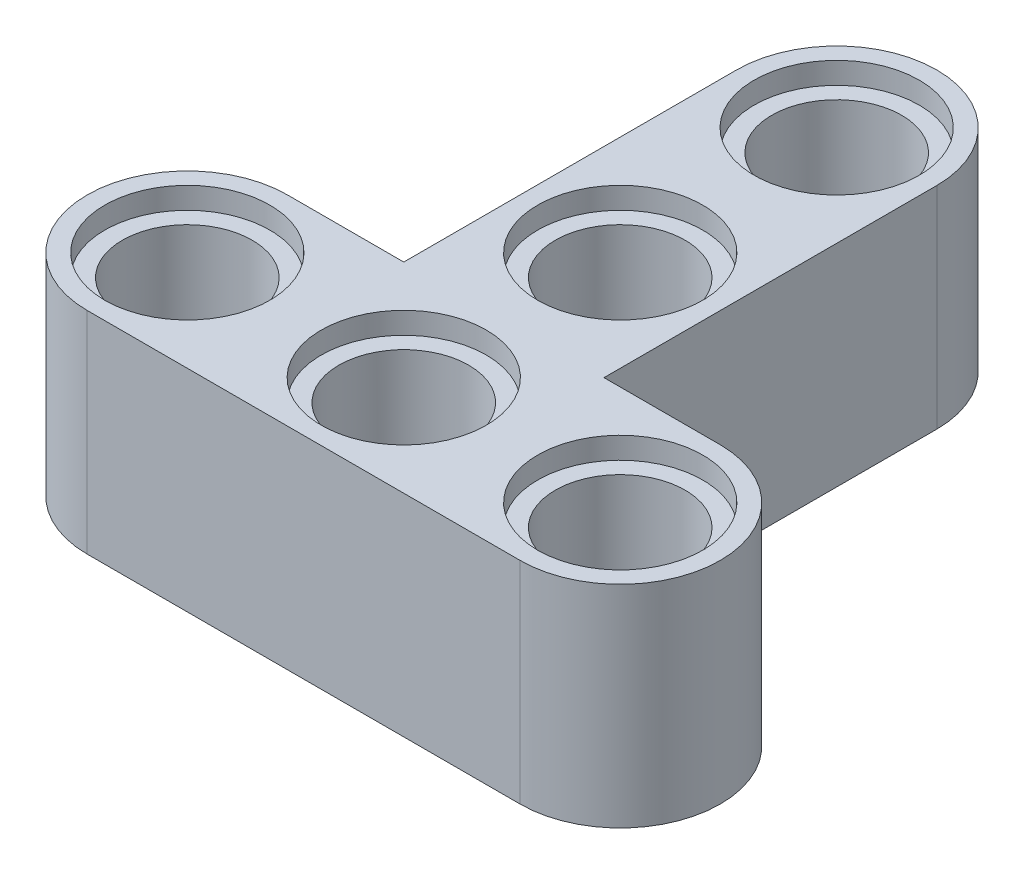
ISO-10303-21;
HEADER;
FILE_DESCRIPTION(('STEP AP214'),'2;1');
FILE_NAME('part.step','',(''),(''),'','','');
FILE_SCHEMA(('AUTOMOTIVE_DESIGN { 1 0 10303 214 1 1 1 1 }'));
ENDSEC;
DATA;
#1=APPLICATION_CONTEXT('core data for automotive mechanical design processes');
#2=APPLICATION_PROTOCOL_DEFINITION('international standard','automotive_design',2000,#1);
#3=PRODUCT_CONTEXT('',#1,'mechanical');
#4=PRODUCT('Part','Part','',(#3));
#5=PRODUCT_RELATED_PRODUCT_CATEGORY('part','',(#4));
#6=PRODUCT_DEFINITION_FORMATION('','',#4);
#7=PRODUCT_DEFINITION_CONTEXT('part definition',#1,'design');
#8=PRODUCT_DEFINITION('design','',#6,#7);
#9=PRODUCT_DEFINITION_SHAPE('','',#8);
#10=(LENGTH_UNIT() NAMED_UNIT(*) SI_UNIT(.MILLI.,.METRE.));
#11=(NAMED_UNIT(*) PLANE_ANGLE_UNIT() SI_UNIT($,.RADIAN.));
#12=(NAMED_UNIT(*) SI_UNIT($,.STERADIAN.) SOLID_ANGLE_UNIT());
#13=UNCERTAINTY_MEASURE_WITH_UNIT(LENGTH_MEASURE(1.E-05),#10,'distance_accuracy_value','');
#14=(GEOMETRIC_REPRESENTATION_CONTEXT(3) GLOBAL_UNCERTAINTY_ASSIGNED_CONTEXT((#13)) GLOBAL_UNIT_ASSIGNED_CONTEXT((#10,
#11,#12)) REPRESENTATION_CONTEXT('',''));
#15=CARTESIAN_POINT('',(0.,0.,0.));
#16=DIRECTION('',(0.,0.,1.));
#17=DIRECTION('',(1.,0.,0.));
#18=AXIS2_PLACEMENT_3D('',#15,#16,#17);
#19=CARTESIAN_POINT('',(-16.,0.,0.));
#20=DIRECTION('',(0.,1.,0.));
#21=DIRECTION('',(0.,0.,1.));
#22=AXIS2_PLACEMENT_3D('',#19,#20,#21);
#23=CYLINDRICAL_SURFACE('',#22,2.4);
#24=CARTESIAN_POINT('',(-16.,7.,0.));
#25=DIRECTION('',(0.,1.,0.));
#26=DIRECTION('',(0.,0.,1.));
#27=AXIS2_PLACEMENT_3D('',#24,#25,#26);
#28=CIRCLE('',#27,2.4);
#29=CARTESIAN_POINT('',(-16.,7.,2.4));
#30=VERTEX_POINT('',#29);
#31=EDGE_CURVE('E176',#30,#30,#28,.F.);
#32=ORIENTED_EDGE('',*,*,#31,.F.);
#33=EDGE_LOOP('',(#32));
#34=FACE_BOUND('',#33,.T.);
#35=CARTESIAN_POINT('',(-16.,0.8,0.));
#36=DIRECTION('',(0.,-1.,0.));
#37=DIRECTION('',(0.,0.,-1.));
#38=AXIS2_PLACEMENT_3D('',#35,#36,#37);
#39=CIRCLE('',#38,2.4);
#40=CARTESIAN_POINT('',(-16.,0.8,-2.4));
#41=VERTEX_POINT('',#40);
#42=EDGE_CURVE('E40',#41,#41,#39,.F.);
#43=ORIENTED_EDGE('',*,*,#42,.F.);
#44=EDGE_LOOP('',(#43));
#45=FACE_BOUND('',#44,.T.);
#46=ADVANCED_FACE('F36',(#34,#45),#23,.F.);
#47=CARTESIAN_POINT('',(-8.,0.,-8.));
#48=DIRECTION('',(0.,1.,0.));
#49=DIRECTION('',(0.,0.,1.));
#50=AXIS2_PLACEMENT_3D('',#47,#48,#49);
#51=CYLINDRICAL_SURFACE('',#50,2.4);
#52=CARTESIAN_POINT('',(-8.,7.,-8.));
#53=DIRECTION('',(0.,1.,0.));
#54=DIRECTION('',(0.,0.,1.));
#55=AXIS2_PLACEMENT_3D('',#52,#53,#54);
#56=CIRCLE('',#55,2.4);
#57=CARTESIAN_POINT('',(-8.,7.,-5.6));
#58=VERTEX_POINT('',#57);
#59=EDGE_CURVE('E169',#58,#58,#56,.F.);
#60=ORIENTED_EDGE('',*,*,#59,.F.);
#61=EDGE_LOOP('',(#60));
#62=FACE_BOUND('',#61,.T.);
#63=CARTESIAN_POINT('',(-8.,0.8,-8.));
#64=DIRECTION('',(0.,-1.,0.));
#65=DIRECTION('',(0.,0.,-1.));
#66=AXIS2_PLACEMENT_3D('',#63,#64,#65);
#67=CIRCLE('',#66,2.4);
#68=CARTESIAN_POINT('',(-8.,0.8,-10.4));
#69=VERTEX_POINT('',#68);
#70=EDGE_CURVE('E190',#69,#69,#67,.F.);
#71=ORIENTED_EDGE('',*,*,#70,.F.);
#72=EDGE_LOOP('',(#71));
#73=FACE_BOUND('',#72,.T.);
#74=ADVANCED_FACE('F255',(#62,#73),#51,.F.);
#75=CARTESIAN_POINT('',(0.,0.,0.));
#76=DIRECTION('',(0.,1.,0.));
#77=DIRECTION('',(0.,0.,1.));
#78=AXIS2_PLACEMENT_3D('',#75,#76,#77);
#79=CYLINDRICAL_SURFACE('',#78,2.4);
#80=CARTESIAN_POINT('',(0.,7.,0.));
#81=DIRECTION('',(0.,1.,0.));
#82=DIRECTION('',(0.,0.,1.));
#83=AXIS2_PLACEMENT_3D('',#80,#81,#82);
#84=CIRCLE('',#83,2.4);
#85=CARTESIAN_POINT('',(0.,7.,2.4));
#86=VERTEX_POINT('',#85);
#87=EDGE_CURVE('E166',#86,#86,#84,.F.);
#88=ORIENTED_EDGE('',*,*,#87,.F.);
#89=EDGE_LOOP('',(#88));
#90=FACE_BOUND('',#89,.T.);
#91=CARTESIAN_POINT('',(0.,0.8,0.));
#92=DIRECTION('',(0.,-1.,0.));
#93=DIRECTION('',(0.,0.,-1.));
#94=AXIS2_PLACEMENT_3D('',#91,#92,#93);
#95=CIRCLE('',#94,2.4);
#96=CARTESIAN_POINT('',(0.,0.8,-2.4));
#97=VERTEX_POINT('',#96);
#98=EDGE_CURVE('E188',#97,#97,#95,.F.);
#99=ORIENTED_EDGE('',*,*,#98,.F.);
#100=EDGE_LOOP('',(#99));
#101=FACE_BOUND('',#100,.T.);
#102=ADVANCED_FACE('F251',(#90,#101),#79,.F.);
#103=CARTESIAN_POINT('',(-8.,0.,-16.));
#104=DIRECTION('',(0.,1.,0.));
#105=DIRECTION('',(0.,0.,1.));
#106=AXIS2_PLACEMENT_3D('',#103,#104,#105);
#107=CYLINDRICAL_SURFACE('',#106,2.4);
#108=CARTESIAN_POINT('',(-8.,7.,-16.));
#109=DIRECTION('',(0.,-1.,0.));
#110=DIRECTION('',(0.,0.,-1.));
#111=AXIS2_PLACEMENT_3D('',#108,#109,#110);
#112=CIRCLE('',#111,2.4);
#113=CARTESIAN_POINT('',(-8.,7.,-18.4));
#114=VERTEX_POINT('',#113);
#115=EDGE_CURVE('E173',#114,#114,#112,.F.);
#116=ORIENTED_EDGE('',*,*,#115,.T.);
#117=EDGE_LOOP('',(#116));
#118=FACE_BOUND('',#117,.T.);
#119=CARTESIAN_POINT('',(-8.,0.8,-16.));
#120=DIRECTION('',(0.,-1.,0.));
#121=DIRECTION('',(0.,0.,-1.));
#122=AXIS2_PLACEMENT_3D('',#119,#120,#121);
#123=CIRCLE('',#122,2.4);
#124=CARTESIAN_POINT('',(-8.,0.8,-18.4));
#125=VERTEX_POINT('',#124);
#126=EDGE_CURVE('E181',#125,#125,#123,.F.);
#127=ORIENTED_EDGE('',*,*,#126,.F.);
#128=EDGE_LOOP('',(#127));
#129=FACE_BOUND('',#128,.T.);
#130=ADVANCED_FACE('F245',(#118,#129),#107,.F.);
#131=CARTESIAN_POINT('',(-16.,7.8,-3.7));
#132=DIRECTION('',(0.,0.,-1.));
#133=DIRECTION('',(-1.,0.,0.));
#134=AXIS2_PLACEMENT_3D('',#131,#132,#133);
#135=PLANE('',#134);
#136=DIRECTION('',(1.,0.,0.));
#137=VECTOR('',#136,1.);
#138=CARTESIAN_POINT('',(-16.,0.,-3.7));
#139=LINE('',#138,#137);
#140=CARTESIAN_POINT('',(-16.,0.,-3.7));
#141=VERTEX_POINT('',#140);
#142=CARTESIAN_POINT('',(-11.7,0.,-3.7));
#143=VERTEX_POINT('',#142);
#144=EDGE_CURVE('E136',#141,#143,#139,.T.);
#145=ORIENTED_EDGE('',*,*,#144,.F.);
#146=DIRECTION('',(0.,-1.,0.));
#147=VECTOR('',#146,1.);
#148=CARTESIAN_POINT('',(-16.,7.8,-3.7));
#149=LINE('',#148,#147);
#150=CARTESIAN_POINT('',(-16.,7.8,-3.7));
#151=VERTEX_POINT('',#150);
#152=EDGE_CURVE('E11',#151,#141,#149,.T.);
#153=ORIENTED_EDGE('',*,*,#152,.F.);
#154=DIRECTION('',(1.,0.,0.));
#155=VECTOR('',#154,1.);
#156=CARTESIAN_POINT('',(-16.,7.8,-3.7));
#157=LINE('',#156,#155);
#158=CARTESIAN_POINT('',(-11.7,7.8,-3.7));
#159=VERTEX_POINT('',#158);
#160=EDGE_CURVE('E154',#151,#159,#157,.T.);
#161=ORIENTED_EDGE('',*,*,#160,.T.);
#162=DIRECTION('',(0.,-1.,0.));
#163=VECTOR('',#162,1.);
#164=CARTESIAN_POINT('',(-11.7,7.8,-3.7));
#165=LINE('',#164,#163);
#166=EDGE_CURVE('E135',#159,#143,#165,.T.);
#167=ORIENTED_EDGE('',*,*,#166,.T.);
#168=EDGE_LOOP('',(#145,#153,#161,#167));
#169=FACE_BOUND('',#168,.T.);
#170=ADVANCED_FACE('F38',(#169),#135,.T.);
#171=CARTESIAN_POINT('',(-16.,7.8,0.));
#172=DIRECTION('',(0.,-1.,0.));
#173=DIRECTION('',(0.,0.,-1.));
#174=AXIS2_PLACEMENT_3D('',#171,#172,#173);
#175=CYLINDRICAL_SURFACE('',#174,3.7);
#176=CARTESIAN_POINT('',(-16.,0.,0.));
#177=DIRECTION('',(0.,1.,0.));
#178=DIRECTION('',(0.,0.,1.));
#179=AXIS2_PLACEMENT_3D('',#176,#177,#178);
#180=CIRCLE('',#179,3.7);
#181=CARTESIAN_POINT('',(-16.,0.,3.7));
#182=VERTEX_POINT('',#181);
#183=EDGE_CURVE('E82',#141,#182,#180,.T.);
#184=ORIENTED_EDGE('',*,*,#183,.T.);
#185=DIRECTION('',(0.,-1.,0.));
#186=VECTOR('',#185,1.);
#187=CARTESIAN_POINT('',(-16.,7.8,3.7));
#188=LINE('',#187,#186);
#189=CARTESIAN_POINT('',(-16.,7.8,3.7));
#190=VERTEX_POINT('',#189);
#191=EDGE_CURVE('E46',#190,#182,#188,.T.);
#192=ORIENTED_EDGE('',*,*,#191,.F.);
#193=CARTESIAN_POINT('',(-16.,7.8,0.));
#194=DIRECTION('',(0.,1.,0.));
#195=DIRECTION('',(0.,0.,1.));
#196=AXIS2_PLACEMENT_3D('',#193,#194,#195);
#197=CIRCLE('',#196,3.7);
#198=EDGE_CURVE('E114',#151,#190,#197,.T.);
#199=ORIENTED_EDGE('',*,*,#198,.F.);
#200=ORIENTED_EDGE('',*,*,#152,.T.);
#201=EDGE_LOOP('',(#184,#192,#199,#200));
#202=FACE_BOUND('',#201,.T.);
#203=ADVANCED_FACE('F244',(#202),#175,.T.);
#204=CARTESIAN_POINT('',(-16.,7.8,3.7));
#205=DIRECTION('',(0.,0.,-1.));
#206=DIRECTION('',(-1.,0.,0.));
#207=AXIS2_PLACEMENT_3D('',#204,#205,#206);
#208=PLANE('',#207);
#209=DIRECTION('',(1.,0.,0.));
#210=VECTOR('',#209,1.);
#211=CARTESIAN_POINT('',(-16.,0.,3.7));
#212=LINE('',#211,#210);
#213=CARTESIAN_POINT('',(0.,0.,3.7));
#214=VERTEX_POINT('',#213);
#215=EDGE_CURVE('E121',#182,#214,#212,.T.);
#216=ORIENTED_EDGE('',*,*,#215,.T.);
#217=DIRECTION('',(0.,-1.,0.));
#218=VECTOR('',#217,1.);
#219=CARTESIAN_POINT('',(0.,7.8,3.7));
#220=LINE('',#219,#218);
#221=CARTESIAN_POINT('',(0.,7.8,3.7));
#222=VERTEX_POINT('',#221);
#223=EDGE_CURVE('E118',#222,#214,#220,.T.);
#224=ORIENTED_EDGE('',*,*,#223,.F.);
#225=DIRECTION('',(1.,0.,0.));
#226=VECTOR('',#225,1.);
#227=CARTESIAN_POINT('',(-16.,7.8,3.7));
#228=LINE('',#227,#226);
#229=EDGE_CURVE('E107',#190,#222,#228,.T.);
#230=ORIENTED_EDGE('',*,*,#229,.F.);
#231=ORIENTED_EDGE('',*,*,#191,.T.);
#232=EDGE_LOOP('',(#216,#224,#230,#231));
#233=FACE_BOUND('',#232,.T.);
#234=ADVANCED_FACE('F119',(#233),#208,.F.);
#235=CARTESIAN_POINT('',(0.,7.8,0.));
#236=DIRECTION('',(0.,-1.,0.));
#237=DIRECTION('',(0.,0.,-1.));
#238=AXIS2_PLACEMENT_3D('',#235,#236,#237);
#239=CYLINDRICAL_SURFACE('',#238,3.7);
#240=CARTESIAN_POINT('',(0.,0.,0.));
#241=DIRECTION('',(0.,-1.,0.));
#242=DIRECTION('',(0.,0.,-1.));
#243=AXIS2_PLACEMENT_3D('',#240,#241,#242);
#244=CIRCLE('',#243,3.7);
#245=CARTESIAN_POINT('',(0.,0.,-3.7));
#246=VERTEX_POINT('',#245);
#247=EDGE_CURVE('E151',#246,#214,#244,.T.);
#248=ORIENTED_EDGE('',*,*,#247,.F.);
#249=DIRECTION('',(0.,-1.,0.));
#250=VECTOR('',#249,1.);
#251=CARTESIAN_POINT('',(0.,7.8,-3.7));
#252=LINE('',#251,#250);
#253=CARTESIAN_POINT('',(0.,7.8,-3.7));
#254=VERTEX_POINT('',#253);
#255=EDGE_CURVE('E125',#254,#246,#252,.T.);
#256=ORIENTED_EDGE('',*,*,#255,.F.);
#257=CARTESIAN_POINT('',(0.,7.8,0.));
#258=DIRECTION('',(0.,-1.,0.));
#259=DIRECTION('',(0.,0.,-1.));
#260=AXIS2_PLACEMENT_3D('',#257,#258,#259);
#261=CIRCLE('',#260,3.7);
#262=EDGE_CURVE('E112',#254,#222,#261,.T.);
#263=ORIENTED_EDGE('',*,*,#262,.T.);
#264=ORIENTED_EDGE('',*,*,#223,.T.);
#265=EDGE_LOOP('',(#248,#256,#263,#264));
#266=FACE_BOUND('',#265,.T.);
#267=ADVANCED_FACE('F127',(#266),#239,.T.);
#268=CARTESIAN_POINT('',(-4.3,7.8,-3.7));
#269=DIRECTION('',(0.,0.,-1.));
#270=DIRECTION('',(-1.,0.,0.));
#271=AXIS2_PLACEMENT_3D('',#268,#269,#270);
#272=PLANE('',#271);
#273=DIRECTION('',(1.,0.,0.));
#274=VECTOR('',#273,1.);
#275=CARTESIAN_POINT('',(-4.3,0.,-3.7));
#276=LINE('',#275,#274);
#277=CARTESIAN_POINT('',(-4.3,0.,-3.7));
#278=VERTEX_POINT('',#277);
#279=EDGE_CURVE('E148',#278,#246,#276,.T.);
#280=ORIENTED_EDGE('',*,*,#279,.F.);
#281=DIRECTION('',(0.,-1.,0.));
#282=VECTOR('',#281,1.);
#283=CARTESIAN_POINT('',(-4.3,7.8,-3.7));
#284=LINE('',#283,#282);
#285=CARTESIAN_POINT('',(-4.3,7.8,-3.7));
#286=VERTEX_POINT('',#285);
#287=EDGE_CURVE('E158',#286,#278,#284,.T.);
#288=ORIENTED_EDGE('',*,*,#287,.F.);
#289=DIRECTION('',(1.,0.,0.));
#290=VECTOR('',#289,1.);
#291=CARTESIAN_POINT('',(-4.3,7.8,-3.7));
#292=LINE('',#291,#290);
#293=EDGE_CURVE('E128',#286,#254,#292,.T.);
#294=ORIENTED_EDGE('',*,*,#293,.T.);
#295=ORIENTED_EDGE('',*,*,#255,.T.);
#296=EDGE_LOOP('',(#280,#288,#294,#295));
#297=FACE_BOUND('',#296,.T.);
#298=ADVANCED_FACE('F234',(#297),#272,.T.);
#299=CARTESIAN_POINT('',(-4.3,7.8,-16.));
#300=DIRECTION('',(1.,0.,0.));
#301=DIRECTION('',(0.,0.,-1.));
#302=AXIS2_PLACEMENT_3D('',#299,#300,#301);
#303=PLANE('',#302);
#304=DIRECTION('',(0.,0.,1.));
#305=VECTOR('',#304,1.);
#306=CARTESIAN_POINT('',(-4.3,0.,-16.));
#307=LINE('',#306,#305);
#308=CARTESIAN_POINT('',(-4.3,0.,-16.));
#309=VERTEX_POINT('',#308);
#310=EDGE_CURVE('E145',#309,#278,#307,.T.);
#311=ORIENTED_EDGE('',*,*,#310,.F.);
#312=DIRECTION('',(0.,-1.,0.));
#313=VECTOR('',#312,1.);
#314=CARTESIAN_POINT('',(-4.3,7.8,-16.));
#315=LINE('',#314,#313);
#316=CARTESIAN_POINT('',(-4.3,7.8,-16.));
#317=VERTEX_POINT('',#316);
#318=EDGE_CURVE('E160',#317,#309,#315,.T.);
#319=ORIENTED_EDGE('',*,*,#318,.F.);
#320=DIRECTION('',(0.,0.,1.));
#321=VECTOR('',#320,1.);
#322=CARTESIAN_POINT('',(-4.3,7.8,-16.));
#323=LINE('',#322,#321);
#324=EDGE_CURVE('E130',#317,#286,#323,.T.);
#325=ORIENTED_EDGE('',*,*,#324,.T.);
#326=ORIENTED_EDGE('',*,*,#287,.T.);
#327=EDGE_LOOP('',(#311,#319,#325,#326));
#328=FACE_BOUND('',#327,.T.);
#329=ADVANCED_FACE('F229',(#328),#303,.T.);
#330=CARTESIAN_POINT('',(-8.,7.8,-16.));
#331=DIRECTION('',(0.,-1.,0.));
#332=DIRECTION('',(0.,0.,-1.));
#333=AXIS2_PLACEMENT_3D('',#330,#331,#332);
#334=CYLINDRICAL_SURFACE('',#333,3.7);
#335=CARTESIAN_POINT('',(-8.,0.,-16.));
#336=DIRECTION('',(0.,1.,0.));
#337=DIRECTION('',(0.,0.,1.));
#338=AXIS2_PLACEMENT_3D('',#335,#336,#337);
#339=CIRCLE('',#338,3.7);
#340=CARTESIAN_POINT('',(-11.7,0.,-16.));
#341=VERTEX_POINT('',#340);
#342=EDGE_CURVE('E143',#309,#341,#339,.T.);
#343=ORIENTED_EDGE('',*,*,#342,.T.);
#344=DIRECTION('',(0.,-1.,0.));
#345=VECTOR('',#344,1.);
#346=CARTESIAN_POINT('',(-11.7,7.8,-16.));
#347=LINE('',#346,#345);
#348=CARTESIAN_POINT('',(-11.7,7.8,-16.));
#349=VERTEX_POINT('',#348);
#350=EDGE_CURVE('E162',#349,#341,#347,.T.);
#351=ORIENTED_EDGE('',*,*,#350,.F.);
#352=CARTESIAN_POINT('',(-8.,7.8,-16.));
#353=DIRECTION('',(0.,1.,0.));
#354=DIRECTION('',(0.,0.,1.));
#355=AXIS2_PLACEMENT_3D('',#352,#353,#354);
#356=CIRCLE('',#355,3.7);
#357=EDGE_CURVE('E224',#317,#349,#356,.T.);
#358=ORIENTED_EDGE('',*,*,#357,.F.);
#359=ORIENTED_EDGE('',*,*,#318,.T.);
#360=EDGE_LOOP('',(#343,#351,#358,#359));
#361=FACE_BOUND('',#360,.T.);
#362=ADVANCED_FACE('F240',(#361),#334,.T.);
#363=CARTESIAN_POINT('',(-11.7,7.8,-16.));
#364=DIRECTION('',(1.,0.,0.));
#365=DIRECTION('',(0.,0.,-1.));
#366=AXIS2_PLACEMENT_3D('',#363,#364,#365);
#367=PLANE('',#366);
#368=DIRECTION('',(0.,0.,1.));
#369=VECTOR('',#368,1.);
#370=CARTESIAN_POINT('',(-11.7,0.,-16.));
#371=LINE('',#370,#369);
#372=EDGE_CURVE('E139',#341,#143,#371,.T.);
#373=ORIENTED_EDGE('',*,*,#372,.T.);
#374=ORIENTED_EDGE('',*,*,#166,.F.);
#375=DIRECTION('',(0.,0.,1.));
#376=VECTOR('',#375,1.);
#377=CARTESIAN_POINT('',(-11.7,7.8,-16.));
#378=LINE('',#377,#376);
#379=EDGE_CURVE('E92',#349,#159,#378,.T.);
#380=ORIENTED_EDGE('',*,*,#379,.F.);
#381=ORIENTED_EDGE('',*,*,#350,.T.);
#382=EDGE_LOOP('',(#373,#374,#380,#381));
#383=FACE_BOUND('',#382,.T.);
#384=ADVANCED_FACE('F242',(#383),#367,.F.);
#385=CARTESIAN_POINT('',(-8.,7.8,-16.));
#386=DIRECTION('',(0.,1.,0.));
#387=DIRECTION('',(0.,0.,1.));
#388=AXIS2_PLACEMENT_3D('',#385,#386,#387);
#389=PLANE('',#388);
#390=CARTESIAN_POINT('',(0.,7.8,0.));
#391=DIRECTION('',(0.,1.,0.));
#392=DIRECTION('',(0.,0.,1.));
#393=AXIS2_PLACEMENT_3D('',#390,#391,#392);
#394=CIRCLE('',#393,3.05);
#395=CARTESIAN_POINT('',(0.,7.8,3.05));
#396=VERTEX_POINT('',#395);
#397=EDGE_CURVE('E211',#396,#396,#394,.T.);
#398=ORIENTED_EDGE('',*,*,#397,.F.);
#399=EDGE_LOOP('',(#398));
#400=FACE_BOUND('',#399,.T.);
#401=CARTESIAN_POINT('',(-8.,7.8,-16.));
#402=DIRECTION('',(0.,1.,0.));
#403=DIRECTION('',(0.,0.,-1.));
#404=AXIS2_PLACEMENT_3D('',#401,#402,#403);
#405=CIRCLE('',#404,3.05);
#406=CARTESIAN_POINT('',(-8.,7.8,-19.05));
#407=VERTEX_POINT('',#406);
#408=EDGE_CURVE('E195',#407,#407,#405,.T.);
#409=ORIENTED_EDGE('',*,*,#408,.F.);
#410=EDGE_LOOP('',(#409));
#411=FACE_BOUND('',#410,.T.);
#412=CARTESIAN_POINT('',(-8.,7.8,0.));
#413=DIRECTION('',(0.,1.,0.));
#414=DIRECTION('',(0.,0.,-1.));
#415=AXIS2_PLACEMENT_3D('',#412,#413,#414);
#416=CIRCLE('',#415,3.05);
#417=CARTESIAN_POINT('',(-8.,7.8,-3.05));
#418=VERTEX_POINT('',#417);
#419=EDGE_CURVE('E204',#418,#418,#416,.T.);
#420=ORIENTED_EDGE('',*,*,#419,.F.);
#421=EDGE_LOOP('',(#420));
#422=FACE_BOUND('',#421,.T.);
#423=CARTESIAN_POINT('',(-16.,7.8,0.));
#424=DIRECTION('',(0.,1.,0.));
#425=DIRECTION('',(0.,0.,1.));
#426=AXIS2_PLACEMENT_3D('',#423,#424,#425);
#427=CIRCLE('',#426,3.05);
#428=CARTESIAN_POINT('',(-16.,7.8,3.05));
#429=VERTEX_POINT('',#428);
#430=EDGE_CURVE('E218',#429,#429,#427,.T.);
#431=ORIENTED_EDGE('',*,*,#430,.F.);
#432=EDGE_LOOP('',(#431));
#433=FACE_BOUND('',#432,.T.);
#434=CARTESIAN_POINT('',(-8.,7.8,-8.));
#435=DIRECTION('',(0.,1.,0.));
#436=DIRECTION('',(0.,0.,1.));
#437=AXIS2_PLACEMENT_3D('',#434,#435,#436);
#438=CIRCLE('',#437,3.05);
#439=CARTESIAN_POINT('',(-8.,7.8,-4.95));
#440=VERTEX_POINT('',#439);
#441=EDGE_CURVE('E212',#440,#440,#438,.T.);
#442=ORIENTED_EDGE('',*,*,#441,.F.);
#443=EDGE_LOOP('',(#442));
#444=FACE_BOUND('',#443,.T.);
#445=ORIENTED_EDGE('',*,*,#160,.F.);
#446=ORIENTED_EDGE('',*,*,#198,.T.);
#447=ORIENTED_EDGE('',*,*,#229,.T.);
#448=ORIENTED_EDGE('',*,*,#262,.F.);
#449=ORIENTED_EDGE('',*,*,#293,.F.);
#450=ORIENTED_EDGE('',*,*,#324,.F.);
#451=ORIENTED_EDGE('',*,*,#357,.T.);
#452=ORIENTED_EDGE('',*,*,#379,.T.);
#453=EDGE_LOOP('',(#445,#446,#447,#448,#449,#450,#451,#452));
#454=FACE_BOUND('',#453,.T.);
#455=ADVANCED_FACE('F109',(#400,#411,#422,#433,#444,#454),#389,.T.);
#456=CARTESIAN_POINT('',(-8.,0.,-16.));
#457=DIRECTION('',(0.,1.,0.));
#458=DIRECTION('',(0.,0.,1.));
#459=AXIS2_PLACEMENT_3D('',#456,#457,#458);
#460=PLANE('',#459);
#461=CARTESIAN_POINT('',(-8.,0.,-16.));
#462=DIRECTION('',(0.,-1.,0.));
#463=DIRECTION('',(0.,0.,-1.));
#464=AXIS2_PLACEMENT_3D('',#461,#462,#463);
#465=CIRCLE('',#464,3.12990096855154);
#466=CARTESIAN_POINT('',(-8.,0.,-19.1299009685515));
#467=VERTEX_POINT('',#466);
#468=EDGE_CURVE('E596',#467,#467,#465,.T.);
#469=ORIENTED_EDGE('',*,*,#468,.F.);
#470=EDGE_LOOP('',(#469));
#471=FACE_BOUND('',#470,.T.);
#472=CARTESIAN_POINT('',(-8.,0.,-8.));
#473=DIRECTION('',(0.,-1.,0.));
#474=DIRECTION('',(0.,0.,-1.));
#475=AXIS2_PLACEMENT_3D('',#472,#473,#474);
#476=CIRCLE('',#475,3.05);
#477=CARTESIAN_POINT('',(-8.,0.,-11.05));
#478=VERTEX_POINT('',#477);
#479=EDGE_CURVE('E586',#478,#478,#476,.T.);
#480=ORIENTED_EDGE('',*,*,#479,.F.);
#481=EDGE_LOOP('',(#480));
#482=FACE_BOUND('',#481,.T.);
#483=CARTESIAN_POINT('',(-8.,0.,0.));
#484=DIRECTION('',(0.,-1.,0.));
#485=DIRECTION('',(0.,0.,1.));
#486=AXIS2_PLACEMENT_3D('',#483,#484,#485);
#487=CIRCLE('',#486,3.05);
#488=CARTESIAN_POINT('',(-8.,0.,3.05));
#489=VERTEX_POINT('',#488);
#490=EDGE_CURVE('E589',#489,#489,#487,.T.);
#491=ORIENTED_EDGE('',*,*,#490,.F.);
#492=EDGE_LOOP('',(#491));
#493=FACE_BOUND('',#492,.T.);
#494=CARTESIAN_POINT('',(-16.,0.,0.));
#495=DIRECTION('',(0.,-1.,0.));
#496=DIRECTION('',(0.,0.,-1.));
#497=AXIS2_PLACEMENT_3D('',#494,#495,#496);
#498=CIRCLE('',#497,3.05);
#499=CARTESIAN_POINT('',(-16.,0.,-3.05));
#500=VERTEX_POINT('',#499);
#501=EDGE_CURVE('E603',#500,#500,#498,.T.);
#502=ORIENTED_EDGE('',*,*,#501,.F.);
#503=EDGE_LOOP('',(#502));
#504=FACE_BOUND('',#503,.T.);
#505=CARTESIAN_POINT('',(0.,0.,0.));
#506=DIRECTION('',(0.,-1.,0.));
#507=DIRECTION('',(0.,0.,-1.));
#508=AXIS2_PLACEMENT_3D('',#505,#506,#507);
#509=CIRCLE('',#508,3.05);
#510=CARTESIAN_POINT('',(0.,0.,-3.05));
#511=VERTEX_POINT('',#510);
#512=EDGE_CURVE('E597',#511,#511,#509,.T.);
#513=ORIENTED_EDGE('',*,*,#512,.F.);
#514=EDGE_LOOP('',(#513));
#515=FACE_BOUND('',#514,.T.);
#516=ORIENTED_EDGE('',*,*,#144,.T.);
#517=ORIENTED_EDGE('',*,*,#372,.F.);
#518=ORIENTED_EDGE('',*,*,#342,.F.);
#519=ORIENTED_EDGE('',*,*,#310,.T.);
#520=ORIENTED_EDGE('',*,*,#279,.T.);
#521=ORIENTED_EDGE('',*,*,#247,.T.);
#522=ORIENTED_EDGE('',*,*,#215,.F.);
#523=ORIENTED_EDGE('',*,*,#183,.F.);
#524=EDGE_LOOP('',(#516,#517,#518,#519,#520,#521,#522,#523));
#525=FACE_BOUND('',#524,.T.);
#526=ADVANCED_FACE('F237',(#471,#482,#493,#504,#515,#525),#460,.F.);
#527=CARTESIAN_POINT('',(-8.,0.,0.));
#528=DIRECTION('',(0.,1.,0.));
#529=DIRECTION('',(0.,0.,1.));
#530=AXIS2_PLACEMENT_3D('',#527,#528,#529);
#531=CYLINDRICAL_SURFACE('',#530,2.4);
#532=CARTESIAN_POINT('',(-8.,0.8,0.));
#533=DIRECTION('',(0.,1.,0.));
#534=DIRECTION('',(0.,0.,1.));
#535=AXIS2_PLACEMENT_3D('',#532,#533,#534);
#536=CIRCLE('',#535,2.4);
#537=CARTESIAN_POINT('',(-8.,0.8,2.4));
#538=VERTEX_POINT('',#537);
#539=EDGE_CURVE('E184',#538,#538,#536,.F.);
#540=ORIENTED_EDGE('',*,*,#539,.T.);
#541=EDGE_LOOP('',(#540));
#542=FACE_BOUND('',#541,.T.);
#543=CARTESIAN_POINT('',(-8.,7.,0.));
#544=DIRECTION('',(0.,-1.,0.));
#545=DIRECTION('',(0.,0.,-1.));
#546=AXIS2_PLACEMENT_3D('',#543,#544,#545);
#547=CIRCLE('',#546,2.4);
#548=CARTESIAN_POINT('',(-8.,7.,-2.4));
#549=VERTEX_POINT('',#548);
#550=EDGE_CURVE('E140',#549,#549,#547,.F.);
#551=ORIENTED_EDGE('',*,*,#550,.T.);
#552=EDGE_LOOP('',(#551));
#553=FACE_BOUND('',#552,.T.);
#554=ADVANCED_FACE('F266',(#542,#553),#531,.F.);
#555=CARTESIAN_POINT('',(0.,7.,0.));
#556=DIRECTION('',(0.,1.,0.));
#557=DIRECTION('',(0.,0.,1.));
#558=AXIS2_PLACEMENT_3D('',#555,#556,#557);
#559=PLANE('',#558);
#560=CARTESIAN_POINT('',(0.,7.,0.));
#561=DIRECTION('',(0.,1.,0.));
#562=DIRECTION('',(0.,0.,1.));
#563=AXIS2_PLACEMENT_3D('',#560,#561,#562);
#564=CIRCLE('',#563,3.05);
#565=CARTESIAN_POINT('',(0.,7.,3.05));
#566=VERTEX_POINT('',#565);
#567=EDGE_CURVE('E170',#566,#566,#564,.T.);
#568=ORIENTED_EDGE('',*,*,#567,.T.);
#569=EDGE_LOOP('',(#568));
#570=FACE_BOUND('',#569,.T.);
#571=ORIENTED_EDGE('',*,*,#87,.T.);
#572=EDGE_LOOP('',(#571));
#573=FACE_BOUND('',#572,.T.);
#574=ADVANCED_FACE('F269',(#570,#573),#559,.T.);
#575=CARTESIAN_POINT('',(0.,7.,0.));
#576=DIRECTION('',(0.,1.,0.));
#577=DIRECTION('',(0.,0.,1.));
#578=AXIS2_PLACEMENT_3D('',#575,#576,#577);
#579=CYLINDRICAL_SURFACE('',#578,3.05);
#580=ORIENTED_EDGE('',*,*,#567,.F.);
#581=EDGE_LOOP('',(#580));
#582=FACE_BOUND('',#581,.T.);
#583=ORIENTED_EDGE('',*,*,#397,.T.);
#584=EDGE_LOOP('',(#583));
#585=FACE_BOUND('',#584,.T.);
#586=ADVANCED_FACE('F311',(#582,#585),#579,.F.);
#587=CARTESIAN_POINT('',(-8.,7.,-8.));
#588=DIRECTION('',(0.,1.,0.));
#589=DIRECTION('',(0.,0.,1.));
#590=AXIS2_PLACEMENT_3D('',#587,#588,#589);
#591=PLANE('',#590);
#592=CARTESIAN_POINT('',(-8.,7.,-8.));
#593=DIRECTION('',(0.,1.,0.));
#594=DIRECTION('',(0.,0.,1.));
#595=AXIS2_PLACEMENT_3D('',#592,#593,#594);
#596=CIRCLE('',#595,3.05);
#597=CARTESIAN_POINT('',(-8.,7.,-4.95));
#598=VERTEX_POINT('',#597);
#599=EDGE_CURVE('E208',#598,#598,#596,.T.);
#600=ORIENTED_EDGE('',*,*,#599,.T.);
#601=EDGE_LOOP('',(#600));
#602=FACE_BOUND('',#601,.T.);
#603=ORIENTED_EDGE('',*,*,#59,.T.);
#604=EDGE_LOOP('',(#603));
#605=FACE_BOUND('',#604,.T.);
#606=ADVANCED_FACE('F319',(#602,#605),#591,.T.);
#607=CARTESIAN_POINT('',(-8.,7.,-8.));
#608=DIRECTION('',(0.,1.,0.));
#609=DIRECTION('',(0.,0.,1.));
#610=AXIS2_PLACEMENT_3D('',#607,#608,#609);
#611=CYLINDRICAL_SURFACE('',#610,3.05);
#612=ORIENTED_EDGE('',*,*,#599,.F.);
#613=EDGE_LOOP('',(#612));
#614=FACE_BOUND('',#613,.T.);
#615=ORIENTED_EDGE('',*,*,#441,.T.);
#616=EDGE_LOOP('',(#615));
#617=FACE_BOUND('',#616,.T.);
#618=ADVANCED_FACE('F327',(#614,#617),#611,.F.);
#619=CARTESIAN_POINT('',(-8.,7.,-16.));
#620=DIRECTION('',(0.,-1.,0.));
#621=DIRECTION('',(0.,0.,-1.));
#622=AXIS2_PLACEMENT_3D('',#619,#620,#621);
#623=PLANE('',#622);
#624=CARTESIAN_POINT('',(-8.,7.,-16.));
#625=DIRECTION('',(0.,1.,0.));
#626=DIRECTION('',(0.,0.,-1.));
#627=AXIS2_PLACEMENT_3D('',#624,#625,#626);
#628=CIRCLE('',#627,3.05);
#629=CARTESIAN_POINT('',(-8.,7.,-19.05));
#630=VERTEX_POINT('',#629);
#631=EDGE_CURVE('E199',#630,#630,#628,.T.);
#632=ORIENTED_EDGE('',*,*,#631,.T.);
#633=EDGE_LOOP('',(#632));
#634=FACE_BOUND('',#633,.T.);
#635=ORIENTED_EDGE('',*,*,#115,.F.);
#636=EDGE_LOOP('',(#635));
#637=FACE_BOUND('',#636,.T.);
#638=ADVANCED_FACE('F335',(#634,#637),#623,.F.);
#639=CARTESIAN_POINT('',(-8.,7.,-16.));
#640=DIRECTION('',(0.,1.,0.));
#641=DIRECTION('',(0.,0.,1.));
#642=AXIS2_PLACEMENT_3D('',#639,#640,#641);
#643=CYLINDRICAL_SURFACE('',#642,3.05);
#644=ORIENTED_EDGE('',*,*,#631,.F.);
#645=EDGE_LOOP('',(#644));
#646=FACE_BOUND('',#645,.T.);
#647=ORIENTED_EDGE('',*,*,#408,.T.);
#648=EDGE_LOOP('',(#647));
#649=FACE_BOUND('',#648,.T.);
#650=ADVANCED_FACE('F343',(#646,#649),#643,.F.);
#651=CARTESIAN_POINT('',(-16.,7.,0.));
#652=DIRECTION('',(0.,1.,0.));
#653=DIRECTION('',(0.,0.,1.));
#654=AXIS2_PLACEMENT_3D('',#651,#652,#653);
#655=PLANE('',#654);
#656=CARTESIAN_POINT('',(-16.,7.,0.));
#657=DIRECTION('',(0.,1.,0.));
#658=DIRECTION('',(0.,0.,1.));
#659=AXIS2_PLACEMENT_3D('',#656,#657,#658);
#660=CIRCLE('',#659,3.05);
#661=CARTESIAN_POINT('',(-16.,7.,3.05));
#662=VERTEX_POINT('',#661);
#663=EDGE_CURVE('E215',#662,#662,#660,.T.);
#664=ORIENTED_EDGE('',*,*,#663,.T.);
#665=EDGE_LOOP('',(#664));
#666=FACE_BOUND('',#665,.T.);
#667=ORIENTED_EDGE('',*,*,#31,.T.);
#668=EDGE_LOOP('',(#667));
#669=FACE_BOUND('',#668,.T.);
#670=ADVANCED_FACE('F351',(#666,#669),#655,.T.);
#671=CARTESIAN_POINT('',(-16.,7.,0.));
#672=DIRECTION('',(0.,1.,0.));
#673=DIRECTION('',(0.,0.,1.));
#674=AXIS2_PLACEMENT_3D('',#671,#672,#673);
#675=CYLINDRICAL_SURFACE('',#674,3.05);
#676=ORIENTED_EDGE('',*,*,#663,.F.);
#677=EDGE_LOOP('',(#676));
#678=FACE_BOUND('',#677,.T.);
#679=ORIENTED_EDGE('',*,*,#430,.T.);
#680=EDGE_LOOP('',(#679));
#681=FACE_BOUND('',#680,.T.);
#682=ADVANCED_FACE('F359',(#678,#681),#675,.F.);
#683=CARTESIAN_POINT('',(-8.,7.,0.));
#684=DIRECTION('',(0.,-1.,0.));
#685=DIRECTION('',(0.,0.,-1.));
#686=AXIS2_PLACEMENT_3D('',#683,#684,#685);
#687=PLANE('',#686);
#688=CARTESIAN_POINT('',(-8.,7.,0.));
#689=DIRECTION('',(0.,1.,0.));
#690=DIRECTION('',(0.,0.,-1.));
#691=AXIS2_PLACEMENT_3D('',#688,#689,#690);
#692=CIRCLE('',#691,3.05);
#693=CARTESIAN_POINT('',(-8.,7.,-3.05));
#694=VERTEX_POINT('',#693);
#695=EDGE_CURVE('E221',#694,#694,#692,.T.);
#696=ORIENTED_EDGE('',*,*,#695,.T.);
#697=EDGE_LOOP('',(#696));
#698=FACE_BOUND('',#697,.T.);
#699=ORIENTED_EDGE('',*,*,#550,.F.);
#700=EDGE_LOOP('',(#699));
#701=FACE_BOUND('',#700,.T.);
#702=ADVANCED_FACE('F367',(#698,#701),#687,.F.);
#703=CARTESIAN_POINT('',(-8.,7.,0.));
#704=DIRECTION('',(0.,1.,0.));
#705=DIRECTION('',(0.,0.,1.));
#706=AXIS2_PLACEMENT_3D('',#703,#704,#705);
#707=CYLINDRICAL_SURFACE('',#706,3.05);
#708=ORIENTED_EDGE('',*,*,#695,.F.);
#709=EDGE_LOOP('',(#708));
#710=FACE_BOUND('',#709,.T.);
#711=ORIENTED_EDGE('',*,*,#419,.T.);
#712=EDGE_LOOP('',(#711));
#713=FACE_BOUND('',#712,.T.);
#714=ADVANCED_FACE('F375',(#710,#713),#707,.F.);
#715=CARTESIAN_POINT('',(-8.,0.8,-16.));
#716=DIRECTION('',(0.,-1.,0.));
#717=DIRECTION('',(0.,0.,-1.));
#718=AXIS2_PLACEMENT_3D('',#715,#716,#717);
#719=PLANE('',#718);
#720=CARTESIAN_POINT('',(-8.,0.8,-16.));
#721=DIRECTION('',(0.,-1.,0.));
#722=DIRECTION('',(0.,0.,-1.));
#723=AXIS2_PLACEMENT_3D('',#720,#721,#722);
#724=CIRCLE('',#723,3.12990096855154);
#725=CARTESIAN_POINT('',(-8.,0.8,-19.1299009685515));
#726=VERTEX_POINT('',#725);
#727=EDGE_CURVE('E185',#726,#726,#724,.T.);
#728=ORIENTED_EDGE('',*,*,#727,.T.);
#729=EDGE_LOOP('',(#728));
#730=FACE_BOUND('',#729,.T.);
#731=ORIENTED_EDGE('',*,*,#126,.T.);
#732=EDGE_LOOP('',(#731));
#733=FACE_BOUND('',#732,.T.);
#734=ADVANCED_FACE('F383',(#730,#733),#719,.T.);
#735=CARTESIAN_POINT('',(-8.,0.8,-16.));
#736=DIRECTION('',(0.,-1.,0.));
#737=DIRECTION('',(0.,0.,-1.));
#738=AXIS2_PLACEMENT_3D('',#735,#736,#737);
#739=CYLINDRICAL_SURFACE('',#738,3.12990096855154);
#740=ORIENTED_EDGE('',*,*,#727,.F.);
#741=EDGE_LOOP('',(#740));
#742=FACE_BOUND('',#741,.T.);
#743=ORIENTED_EDGE('',*,*,#468,.T.);
#744=EDGE_LOOP('',(#743));
#745=FACE_BOUND('',#744,.T.);
#746=ADVANCED_FACE('F390',(#742,#745),#739,.F.);
#747=CARTESIAN_POINT('',(-8.,0.8,0.));
#748=DIRECTION('',(0.,1.,0.));
#749=DIRECTION('',(0.,0.,1.));
#750=AXIS2_PLACEMENT_3D('',#747,#748,#749);
#751=PLANE('',#750);
#752=CARTESIAN_POINT('',(-8.,0.8,0.));
#753=DIRECTION('',(0.,-1.,0.));
#754=DIRECTION('',(0.,0.,1.));
#755=AXIS2_PLACEMENT_3D('',#752,#753,#754);
#756=CIRCLE('',#755,3.05);
#757=CARTESIAN_POINT('',(-8.,0.8,3.05));
#758=VERTEX_POINT('',#757);
#759=EDGE_CURVE('E606',#758,#758,#756,.T.);
#760=ORIENTED_EDGE('',*,*,#759,.T.);
#761=EDGE_LOOP('',(#760));
#762=FACE_BOUND('',#761,.T.);
#763=ORIENTED_EDGE('',*,*,#539,.F.);
#764=EDGE_LOOP('',(#763));
#765=FACE_BOUND('',#764,.T.);
#766=ADVANCED_FACE('F398',(#762,#765),#751,.F.);
#767=CARTESIAN_POINT('',(-8.,0.8,0.));
#768=DIRECTION('',(0.,-1.,0.));
#769=DIRECTION('',(0.,0.,-1.));
#770=AXIS2_PLACEMENT_3D('',#767,#768,#769);
#771=CYLINDRICAL_SURFACE('',#770,3.05);
#772=ORIENTED_EDGE('',*,*,#759,.F.);
#773=EDGE_LOOP('',(#772));
#774=FACE_BOUND('',#773,.T.);
#775=ORIENTED_EDGE('',*,*,#490,.T.);
#776=EDGE_LOOP('',(#775));
#777=FACE_BOUND('',#776,.T.);
#778=ADVANCED_FACE('F406',(#774,#777),#771,.F.);
#779=CARTESIAN_POINT('',(0.,0.8,0.));
#780=DIRECTION('',(0.,-1.,0.));
#781=DIRECTION('',(0.,0.,-1.));
#782=AXIS2_PLACEMENT_3D('',#779,#780,#781);
#783=PLANE('',#782);
#784=CARTESIAN_POINT('',(0.,0.8,0.));
#785=DIRECTION('',(0.,-1.,0.));
#786=DIRECTION('',(0.,0.,-1.));
#787=AXIS2_PLACEMENT_3D('',#784,#785,#786);
#788=CIRCLE('',#787,3.05);
#789=CARTESIAN_POINT('',(0.,0.8,-3.05));
#790=VERTEX_POINT('',#789);
#791=EDGE_CURVE('E593',#790,#790,#788,.T.);
#792=ORIENTED_EDGE('',*,*,#791,.T.);
#793=EDGE_LOOP('',(#792));
#794=FACE_BOUND('',#793,.T.);
#795=ORIENTED_EDGE('',*,*,#98,.T.);
#796=EDGE_LOOP('',(#795));
#797=FACE_BOUND('',#796,.T.);
#798=ADVANCED_FACE('F414',(#794,#797),#783,.T.);
#799=CARTESIAN_POINT('',(0.,0.8,0.));
#800=DIRECTION('',(0.,-1.,0.));
#801=DIRECTION('',(0.,0.,-1.));
#802=AXIS2_PLACEMENT_3D('',#799,#800,#801);
#803=CYLINDRICAL_SURFACE('',#802,3.05);
#804=ORIENTED_EDGE('',*,*,#791,.F.);
#805=EDGE_LOOP('',(#804));
#806=FACE_BOUND('',#805,.T.);
#807=ORIENTED_EDGE('',*,*,#512,.T.);
#808=EDGE_LOOP('',(#807));
#809=FACE_BOUND('',#808,.T.);
#810=ADVANCED_FACE('F422',(#806,#809),#803,.F.);
#811=CARTESIAN_POINT('',(-16.,0.8,0.));
#812=DIRECTION('',(0.,-1.,0.));
#813=DIRECTION('',(0.,0.,-1.));
#814=AXIS2_PLACEMENT_3D('',#811,#812,#813);
#815=PLANE('',#814);
#816=CARTESIAN_POINT('',(-16.,0.8,0.));
#817=DIRECTION('',(0.,-1.,0.));
#818=DIRECTION('',(0.,0.,-1.));
#819=AXIS2_PLACEMENT_3D('',#816,#817,#818);
#820=CIRCLE('',#819,3.05);
#821=CARTESIAN_POINT('',(-16.,0.8,-3.05));
#822=VERTEX_POINT('',#821);
#823=EDGE_CURVE('E600',#822,#822,#820,.T.);
#824=ORIENTED_EDGE('',*,*,#823,.T.);
#825=EDGE_LOOP('',(#824));
#826=FACE_BOUND('',#825,.T.);
#827=ORIENTED_EDGE('',*,*,#42,.T.);
#828=EDGE_LOOP('',(#827));
#829=FACE_BOUND('',#828,.T.);
#830=ADVANCED_FACE('F430',(#826,#829),#815,.T.);
#831=CARTESIAN_POINT('',(-16.,0.8,0.));
#832=DIRECTION('',(0.,-1.,0.));
#833=DIRECTION('',(0.,0.,-1.));
#834=AXIS2_PLACEMENT_3D('',#831,#832,#833);
#835=CYLINDRICAL_SURFACE('',#834,3.05);
#836=ORIENTED_EDGE('',*,*,#823,.F.);
#837=EDGE_LOOP('',(#836));
#838=FACE_BOUND('',#837,.T.);
#839=ORIENTED_EDGE('',*,*,#501,.T.);
#840=EDGE_LOOP('',(#839));
#841=FACE_BOUND('',#840,.T.);
#842=ADVANCED_FACE('F438',(#838,#841),#835,.F.);
#843=CARTESIAN_POINT('',(-8.,0.8,-8.));
#844=DIRECTION('',(0.,-1.,0.));
#845=DIRECTION('',(0.,0.,-1.));
#846=AXIS2_PLACEMENT_3D('',#843,#844,#845);
#847=PLANE('',#846);
#848=CARTESIAN_POINT('',(-8.,0.8,-8.));
#849=DIRECTION('',(0.,-1.,0.));
#850=DIRECTION('',(0.,0.,-1.));
#851=AXIS2_PLACEMENT_3D('',#848,#849,#850);
#852=CIRCLE('',#851,3.05);
#853=CARTESIAN_POINT('',(-8.,0.8,-11.05));
#854=VERTEX_POINT('',#853);
#855=EDGE_CURVE('E583',#854,#854,#852,.T.);
#856=ORIENTED_EDGE('',*,*,#855,.T.);
#857=EDGE_LOOP('',(#856));
#858=FACE_BOUND('',#857,.T.);
#859=ORIENTED_EDGE('',*,*,#70,.T.);
#860=EDGE_LOOP('',(#859));
#861=FACE_BOUND('',#860,.T.);
#862=ADVANCED_FACE('F446',(#858,#861),#847,.T.);
#863=CARTESIAN_POINT('',(-8.,0.8,-8.));
#864=DIRECTION('',(0.,-1.,0.));
#865=DIRECTION('',(0.,0.,-1.));
#866=AXIS2_PLACEMENT_3D('',#863,#864,#865);
#867=CYLINDRICAL_SURFACE('',#866,3.05);
#868=ORIENTED_EDGE('',*,*,#855,.F.);
#869=EDGE_LOOP('',(#868));
#870=FACE_BOUND('',#869,.T.);
#871=ORIENTED_EDGE('',*,*,#479,.T.);
#872=EDGE_LOOP('',(#871));
#873=FACE_BOUND('',#872,.T.);
#874=ADVANCED_FACE('F454',(#870,#873),#867,.F.);
#875=CLOSED_SHELL('',(#46,#74,#102,#130,#170,#203,#234,#267,#298,#329,#362,#384,#455,#526,#554,
#574,#586,#606,#618,#638,#650,#670,#682,#702,#714,#734,#746,#766,#778,#798,#810,#830,#842,#862,#874));
#876=MANIFOLD_SOLID_BREP('B2',#875);
#877=ADVANCED_BREP_SHAPE_REPRESENTATION('',(#18,#876),#14);
#878=SHAPE_DEFINITION_REPRESENTATION(#9,#877);
ENDSEC;
END-ISO-10303-21;
